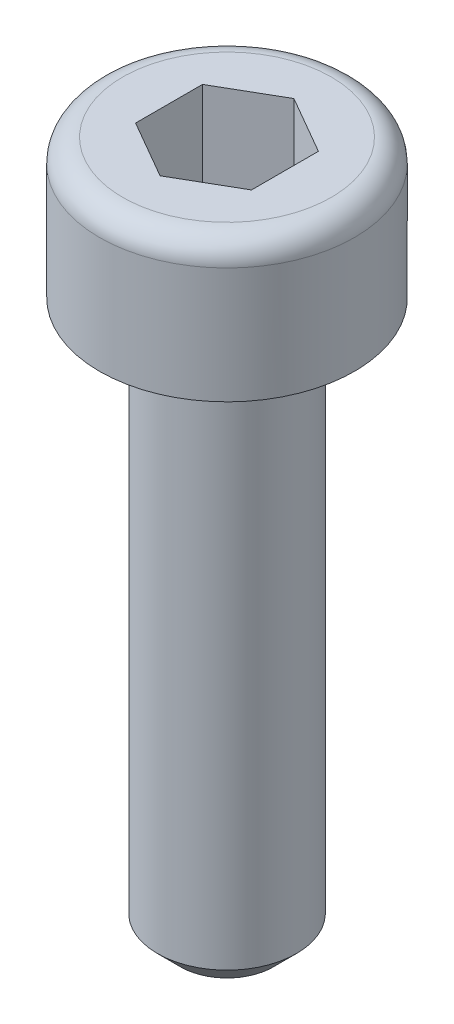
ISO-10303-21;
HEADER;
FILE_DESCRIPTION(('STEP AP214'),'2;1');
FILE_NAME('part.step','',(''),(''),'','','');
FILE_SCHEMA(('AUTOMOTIVE_DESIGN { 1 0 10303 214 1 1 1 1 }'));
ENDSEC;
DATA;
#1=APPLICATION_CONTEXT('core data for automotive mechanical design processes');
#2=APPLICATION_PROTOCOL_DEFINITION('international standard','automotive_design',2000,#1);
#3=PRODUCT_CONTEXT('',#1,'mechanical');
#4=PRODUCT('Part','Part','',(#3));
#5=PRODUCT_RELATED_PRODUCT_CATEGORY('part','',(#4));
#6=PRODUCT_DEFINITION_FORMATION('','',#4);
#7=PRODUCT_DEFINITION_CONTEXT('part definition',#1,'design');
#8=PRODUCT_DEFINITION('design','',#6,#7);
#9=PRODUCT_DEFINITION_SHAPE('','',#8);
#10=(LENGTH_UNIT() NAMED_UNIT(*) SI_UNIT(.MILLI.,.METRE.));
#11=(NAMED_UNIT(*) PLANE_ANGLE_UNIT() SI_UNIT($,.RADIAN.));
#12=(NAMED_UNIT(*) SI_UNIT($,.STERADIAN.) SOLID_ANGLE_UNIT());
#13=UNCERTAINTY_MEASURE_WITH_UNIT(LENGTH_MEASURE(1.E-05),#10,'distance_accuracy_value','');
#14=(GEOMETRIC_REPRESENTATION_CONTEXT(3) GLOBAL_UNCERTAINTY_ASSIGNED_CONTEXT((#13)) GLOBAL_UNIT_ASSIGNED_CONTEXT((#10,
#11,#12)) REPRESENTATION_CONTEXT('',''));
#15=CARTESIAN_POINT('',(0.,0.,0.));
#16=DIRECTION('',(0.,0.,1.));
#17=DIRECTION('',(1.,0.,0.));
#18=AXIS2_PLACEMENT_3D('',#15,#16,#17);
#19=CARTESIAN_POINT('',(0.,0.,0.));
#20=DIRECTION('',(0.,-1.,0.));
#21=DIRECTION('',(0.,0.,-1.));
#22=AXIS2_PLACEMENT_3D('',#19,#20,#21);
#23=PLANE('',#22);
#24=CARTESIAN_POINT('',(0.,0.,0.));
#25=DIRECTION('',(0.,-1.,0.));
#26=DIRECTION('',(0.,0.,-1.));
#27=AXIS2_PLACEMENT_3D('',#24,#25,#26);
#28=CIRCLE('',#27,2.25);
#29=CARTESIAN_POINT('',(0.,0.,-2.25));
#30=VERTEX_POINT('',#29);
#31=EDGE_CURVE('E43',#30,#30,#28,.F.);
#32=ORIENTED_EDGE('',*,*,#31,.T.);
#33=EDGE_LOOP('',(#32));
#34=FACE_BOUND('',#33,.T.);
#35=DIRECTION('',(-0.866025403784439,0.,-0.5));
#36=VECTOR('',#35,1.);
#37=CARTESIAN_POINT('',(1.25,0.,-0.721687836487032));
#38=LINE('',#37,#36);
#39=CARTESIAN_POINT('',(1.25,0.,-0.721687836487032));
#40=VERTEX_POINT('',#39);
#41=CARTESIAN_POINT('',(0.,0.,-1.44337567297406));
#42=VERTEX_POINT('',#41);
#43=EDGE_CURVE('E124',#40,#42,#38,.T.);
#44=ORIENTED_EDGE('',*,*,#43,.F.);
#45=DIRECTION('',(0.,0.,-1.));
#46=VECTOR('',#45,1.);
#47=CARTESIAN_POINT('',(1.25,0.,0.721687836487033));
#48=LINE('',#47,#46);
#49=CARTESIAN_POINT('',(1.25,0.,0.721687836487033));
#50=VERTEX_POINT('',#49);
#51=EDGE_CURVE('E50',#50,#40,#48,.T.);
#52=ORIENTED_EDGE('',*,*,#51,.F.);
#53=DIRECTION('',(0.866025403784439,0.,-0.5));
#54=VECTOR('',#53,1.);
#55=CARTESIAN_POINT('',(0.,0.,1.44337567297406));
#56=LINE('',#55,#54);
#57=CARTESIAN_POINT('',(0.,0.,1.44337567297406));
#58=VERTEX_POINT('',#57);
#59=EDGE_CURVE('E133',#58,#50,#56,.T.);
#60=ORIENTED_EDGE('',*,*,#59,.F.);
#61=DIRECTION('',(0.866025403784439,0.,0.5));
#62=VECTOR('',#61,1.);
#63=CARTESIAN_POINT('',(-1.25,0.,0.721687836487031));
#64=LINE('',#63,#62);
#65=CARTESIAN_POINT('',(-1.25,0.,0.721687836487031));
#66=VERTEX_POINT('',#65);
#67=EDGE_CURVE('E131',#66,#58,#64,.T.);
#68=ORIENTED_EDGE('',*,*,#67,.F.);
#69=DIRECTION('',(0.,0.,1.));
#70=VECTOR('',#69,1.);
#71=CARTESIAN_POINT('',(-1.25,0.,-0.721687836487033));
#72=LINE('',#71,#70);
#73=CARTESIAN_POINT('',(-1.25,0.,-0.721687836487033));
#74=VERTEX_POINT('',#73);
#75=EDGE_CURVE('E98',#74,#66,#72,.T.);
#76=ORIENTED_EDGE('',*,*,#75,.F.);
#77=DIRECTION('',(-0.866025403784439,0.,0.5));
#78=VECTOR('',#77,1.);
#79=CARTESIAN_POINT('',(0.,0.,-1.44337567297406));
#80=LINE('',#79,#78);
#81=EDGE_CURVE('E127',#42,#74,#80,.T.);
#82=ORIENTED_EDGE('',*,*,#81,.F.);
#83=EDGE_LOOP('',(#44,#52,#60,#68,#76,#82));
#84=FACE_BOUND('',#83,.T.);
#85=ADVANCED_FACE('F35',(#34,#84),#23,.F.);
#86=CARTESIAN_POINT('',(0.,0.,0.));
#87=DIRECTION('',(0.,1.,0.));
#88=DIRECTION('',(0.,0.,1.));
#89=AXIS2_PLACEMENT_3D('',#86,#87,#88);
#90=CYLINDRICAL_SURFACE('',#89,2.75);
#91=CARTESIAN_POINT('',(0.,-0.5,0.));
#92=DIRECTION('',(0.,-1.,0.));
#93=DIRECTION('',(0.,0.,-1.));
#94=AXIS2_PLACEMENT_3D('',#91,#92,#93);
#95=CIRCLE('',#94,2.75);
#96=CARTESIAN_POINT('',(0.,-0.5,-2.75));
#97=VERTEX_POINT('',#96);
#98=EDGE_CURVE('E11',#97,#97,#95,.T.);
#99=ORIENTED_EDGE('',*,*,#98,.T.);
#100=EDGE_LOOP('',(#99));
#101=FACE_BOUND('',#100,.T.);
#102=CARTESIAN_POINT('',(0.,-3.,0.));
#103=DIRECTION('',(0.,1.,0.));
#104=DIRECTION('',(0.,0.,1.));
#105=AXIS2_PLACEMENT_3D('',#102,#103,#104);
#106=CIRCLE('',#105,2.75);
#107=CARTESIAN_POINT('',(0.,-3.,2.75));
#108=VERTEX_POINT('',#107);
#109=EDGE_CURVE('E145',#108,#108,#106,.T.);
#110=ORIENTED_EDGE('',*,*,#109,.T.);
#111=EDGE_LOOP('',(#110));
#112=FACE_BOUND('',#111,.T.);
#113=ADVANCED_FACE('F167',(#101,#112),#90,.T.);
#114=CARTESIAN_POINT('',(2.75,-3.,0.));
#115=DIRECTION('',(0.,1.,0.));
#116=DIRECTION('',(0.,0.,1.));
#117=AXIS2_PLACEMENT_3D('',#114,#115,#116);
#118=PLANE('',#117);
#119=ORIENTED_EDGE('',*,*,#109,.F.);
#120=EDGE_LOOP('',(#119));
#121=FACE_BOUND('',#120,.T.);
#122=CARTESIAN_POINT('',(0.,-3.,0.));
#123=DIRECTION('',(0.,1.,0.));
#124=DIRECTION('',(0.,0.,1.));
#125=AXIS2_PLACEMENT_3D('',#122,#123,#124);
#126=CIRCLE('',#125,1.5);
#127=CARTESIAN_POINT('',(0.,-3.,1.5));
#128=VERTEX_POINT('',#127);
#129=EDGE_CURVE('E137',#128,#128,#126,.T.);
#130=ORIENTED_EDGE('',*,*,#129,.T.);
#131=EDGE_LOOP('',(#130));
#132=FACE_BOUND('',#131,.T.);
#133=ADVANCED_FACE('F172',(#121,#132),#118,.F.);
#134=CARTESIAN_POINT('',(0.,0.,0.));
#135=DIRECTION('',(0.,1.,0.));
#136=DIRECTION('',(0.,0.,1.));
#137=AXIS2_PLACEMENT_3D('',#134,#135,#136);
#138=CYLINDRICAL_SURFACE('',#137,1.5);
#139=CARTESIAN_POINT('',(0.,-14.5,0.));
#140=DIRECTION('',(0.,1.,0.));
#141=DIRECTION('',(0.,0.,1.));
#142=AXIS2_PLACEMENT_3D('',#139,#140,#141);
#143=CIRCLE('',#142,1.5);
#144=CARTESIAN_POINT('',(0.,-14.5,1.5));
#145=VERTEX_POINT('',#144);
#146=EDGE_CURVE('E148',#145,#145,#143,.T.);
#147=ORIENTED_EDGE('',*,*,#146,.T.);
#148=EDGE_LOOP('',(#147));
#149=FACE_BOUND('',#148,.T.);
#150=ORIENTED_EDGE('',*,*,#129,.F.);
#151=EDGE_LOOP('',(#150));
#152=FACE_BOUND('',#151,.T.);
#153=ADVANCED_FACE('F178',(#149,#152),#138,.T.);
#154=CARTESIAN_POINT('',(1.5,-15.,0.));
#155=DIRECTION('',(0.,1.,0.));
#156=DIRECTION('',(0.,0.,1.));
#157=AXIS2_PLACEMENT_3D('',#154,#155,#156);
#158=PLANE('',#157);
#159=CARTESIAN_POINT('',(0.,-15.,0.));
#160=DIRECTION('',(0.,1.,0.));
#161=DIRECTION('',(0.,0.,1.));
#162=AXIS2_PLACEMENT_3D('',#159,#160,#161);
#163=CIRCLE('',#162,1.);
#164=CARTESIAN_POINT('',(0.,-15.,1.));
#165=VERTEX_POINT('',#164);
#166=EDGE_CURVE('E151',#165,#165,#163,.F.);
#167=ORIENTED_EDGE('',*,*,#166,.T.);
#168=EDGE_LOOP('',(#167));
#169=FACE_BOUND('',#168,.T.);
#170=ADVANCED_FACE('F182',(#169),#158,.F.);
#171=CARTESIAN_POINT('',(1.25,-2.,0.721687836487033));
#172=DIRECTION('',(1.,0.,0.));
#173=DIRECTION('',(0.,0.,-1.));
#174=AXIS2_PLACEMENT_3D('',#171,#172,#173);
#175=PLANE('',#174);
#176=ORIENTED_EDGE('',*,*,#51,.T.);
#177=DIRECTION('',(0.,1.,0.));
#178=VECTOR('',#177,1.);
#179=CARTESIAN_POINT('',(1.25,-2.,-0.721687836487032));
#180=LINE('',#179,#178);
#181=CARTESIAN_POINT('',(1.25,-2.,-0.721687836487032));
#182=VERTEX_POINT('',#181);
#183=EDGE_CURVE('E80',#182,#40,#180,.T.);
#184=ORIENTED_EDGE('',*,*,#183,.F.);
#185=DIRECTION('',(0.,0.,-1.));
#186=VECTOR('',#185,1.);
#187=CARTESIAN_POINT('',(1.25,-2.,0.721687836487033));
#188=LINE('',#187,#186);
#189=CARTESIAN_POINT('',(1.25,-2.,0.721687836487033));
#190=VERTEX_POINT('',#189);
#191=EDGE_CURVE('E135',#190,#182,#188,.T.);
#192=ORIENTED_EDGE('',*,*,#191,.F.);
#193=DIRECTION('',(0.,1.,0.));
#194=VECTOR('',#193,1.);
#195=CARTESIAN_POINT('',(1.25,-2.,0.721687836487033));
#196=LINE('',#195,#194);
#197=EDGE_CURVE('E58',#190,#50,#196,.T.);
#198=ORIENTED_EDGE('',*,*,#197,.T.);
#199=EDGE_LOOP('',(#176,#184,#192,#198));
#200=FACE_BOUND('',#199,.T.);
#201=ADVANCED_FACE('F186',(#200),#175,.F.);
#202=CARTESIAN_POINT('',(0.,-2.,1.44337567297406));
#203=DIRECTION('',(0.5,0.,0.866025403784439));
#204=DIRECTION('',(0.866025403784439,0.,-0.5));
#205=AXIS2_PLACEMENT_3D('',#202,#203,#204);
#206=PLANE('',#205);
#207=ORIENTED_EDGE('',*,*,#59,.T.);
#208=ORIENTED_EDGE('',*,*,#197,.F.);
#209=DIRECTION('',(0.866025403784439,0.,-0.5));
#210=VECTOR('',#209,1.);
#211=CARTESIAN_POINT('',(0.,-2.,1.44337567297406));
#212=LINE('',#211,#210);
#213=CARTESIAN_POINT('',(0.,-2.,1.44337567297406));
#214=VERTEX_POINT('',#213);
#215=EDGE_CURVE('E110',#214,#190,#212,.T.);
#216=ORIENTED_EDGE('',*,*,#215,.F.);
#217=DIRECTION('',(0.,1.,0.));
#218=VECTOR('',#217,1.);
#219=CARTESIAN_POINT('',(0.,-2.,1.44337567297406));
#220=LINE('',#219,#218);
#221=EDGE_CURVE('E102',#214,#58,#220,.T.);
#222=ORIENTED_EDGE('',*,*,#221,.T.);
#223=EDGE_LOOP('',(#207,#208,#216,#222));
#224=FACE_BOUND('',#223,.T.);
#225=ADVANCED_FACE('F190',(#224),#206,.F.);
#226=CARTESIAN_POINT('',(-1.25,-2.,0.721687836487031));
#227=DIRECTION('',(-0.5,0.,0.866025403784439));
#228=DIRECTION('',(0.866025403784439,0.,0.5));
#229=AXIS2_PLACEMENT_3D('',#226,#227,#228);
#230=PLANE('',#229);
#231=ORIENTED_EDGE('',*,*,#67,.T.);
#232=ORIENTED_EDGE('',*,*,#221,.F.);
#233=DIRECTION('',(0.866025403784439,0.,0.5));
#234=VECTOR('',#233,1.);
#235=CARTESIAN_POINT('',(-1.25,-2.,0.721687836487031));
#236=LINE('',#235,#234);
#237=CARTESIAN_POINT('',(-1.25,-2.,0.721687836487031));
#238=VERTEX_POINT('',#237);
#239=EDGE_CURVE('E106',#238,#214,#236,.T.);
#240=ORIENTED_EDGE('',*,*,#239,.F.);
#241=DIRECTION('',(0.,1.,0.));
#242=VECTOR('',#241,1.);
#243=CARTESIAN_POINT('',(-1.25,-2.,0.721687836487031));
#244=LINE('',#243,#242);
#245=EDGE_CURVE('E91',#238,#66,#244,.T.);
#246=ORIENTED_EDGE('',*,*,#245,.T.);
#247=EDGE_LOOP('',(#231,#232,#240,#246));
#248=FACE_BOUND('',#247,.T.);
#249=ADVANCED_FACE('F107',(#248),#230,.F.);
#250=CARTESIAN_POINT('',(-1.25,-2.,-0.721687836487033));
#251=DIRECTION('',(-1.,0.,0.));
#252=DIRECTION('',(0.,0.,1.));
#253=AXIS2_PLACEMENT_3D('',#250,#251,#252);
#254=PLANE('',#253);
#255=ORIENTED_EDGE('',*,*,#75,.T.);
#256=ORIENTED_EDGE('',*,*,#245,.F.);
#257=DIRECTION('',(0.,0.,1.));
#258=VECTOR('',#257,1.);
#259=CARTESIAN_POINT('',(-1.25,-2.,-0.721687836487033));
#260=LINE('',#259,#258);
#261=CARTESIAN_POINT('',(-1.25,-2.,-0.721687836487033));
#262=VERTEX_POINT('',#261);
#263=EDGE_CURVE('E95',#262,#238,#260,.T.);
#264=ORIENTED_EDGE('',*,*,#263,.F.);
#265=DIRECTION('',(0.,1.,0.));
#266=VECTOR('',#265,1.);
#267=CARTESIAN_POINT('',(-1.25,-2.,-0.721687836487033));
#268=LINE('',#267,#266);
#269=EDGE_CURVE('E103',#262,#74,#268,.T.);
#270=ORIENTED_EDGE('',*,*,#269,.T.);
#271=EDGE_LOOP('',(#255,#256,#264,#270));
#272=FACE_BOUND('',#271,.T.);
#273=ADVANCED_FACE('F93',(#272),#254,.F.);
#274=CARTESIAN_POINT('',(0.,-2.,-1.44337567297406));
#275=DIRECTION('',(-0.5,0.,-0.866025403784439));
#276=DIRECTION('',(-0.866025403784439,0.,0.5));
#277=AXIS2_PLACEMENT_3D('',#274,#275,#276);
#278=PLANE('',#277);
#279=ORIENTED_EDGE('',*,*,#81,.T.);
#280=ORIENTED_EDGE('',*,*,#269,.F.);
#281=DIRECTION('',(-0.866025403784439,0.,0.5));
#282=VECTOR('',#281,1.);
#283=CARTESIAN_POINT('',(0.,-2.,-1.44337567297406));
#284=LINE('',#283,#282);
#285=CARTESIAN_POINT('',(0.,-2.,-1.44337567297406));
#286=VERTEX_POINT('',#285);
#287=EDGE_CURVE('E116',#286,#262,#284,.T.);
#288=ORIENTED_EDGE('',*,*,#287,.F.);
#289=DIRECTION('',(0.,1.,0.));
#290=VECTOR('',#289,1.);
#291=CARTESIAN_POINT('',(0.,-2.,-1.44337567297406));
#292=LINE('',#291,#290);
#293=EDGE_CURVE('E140',#286,#42,#292,.T.);
#294=ORIENTED_EDGE('',*,*,#293,.T.);
#295=EDGE_LOOP('',(#279,#280,#288,#294));
#296=FACE_BOUND('',#295,.T.);
#297=ADVANCED_FACE('F194',(#296),#278,.F.);
#298=CARTESIAN_POINT('',(1.25,-2.,-0.721687836487032));
#299=DIRECTION('',(0.5,0.,-0.866025403784439));
#300=DIRECTION('',(-0.866025403784439,0.,-0.5));
#301=AXIS2_PLACEMENT_3D('',#298,#299,#300);
#302=PLANE('',#301);
#303=ORIENTED_EDGE('',*,*,#43,.T.);
#304=ORIENTED_EDGE('',*,*,#293,.F.);
#305=DIRECTION('',(-0.866025403784439,0.,-0.5));
#306=VECTOR('',#305,1.);
#307=CARTESIAN_POINT('',(1.25,-2.,-0.721687836487032));
#308=LINE('',#307,#306);
#309=EDGE_CURVE('E118',#182,#286,#308,.T.);
#310=ORIENTED_EDGE('',*,*,#309,.F.);
#311=ORIENTED_EDGE('',*,*,#183,.T.);
#312=EDGE_LOOP('',(#303,#304,#310,#311));
#313=FACE_BOUND('',#312,.T.);
#314=ADVANCED_FACE('F191',(#313),#302,.F.);
#315=CARTESIAN_POINT('',(1.25,-2.,-0.721687836487032));
#316=DIRECTION('',(0.,1.,0.));
#317=DIRECTION('',(0.,0.,1.));
#318=AXIS2_PLACEMENT_3D('',#315,#316,#317);
#319=PLANE('',#318);
#320=ORIENTED_EDGE('',*,*,#191,.T.);
#321=ORIENTED_EDGE('',*,*,#309,.T.);
#322=ORIENTED_EDGE('',*,*,#287,.T.);
#323=ORIENTED_EDGE('',*,*,#263,.T.);
#324=ORIENTED_EDGE('',*,*,#239,.T.);
#325=ORIENTED_EDGE('',*,*,#215,.T.);
#326=EDGE_LOOP('',(#320,#321,#322,#323,#324,#325));
#327=FACE_BOUND('',#326,.T.);
#328=ADVANCED_FACE('F113',(#327),#319,.T.);
#329=CARTESIAN_POINT('',(0.,-14.5,0.));
#330=DIRECTION('',(0.,1.,0.));
#331=DIRECTION('',(0.,0.,1.));
#332=AXIS2_PLACEMENT_3D('',#329,#330,#331);
#333=CONICAL_SURFACE('',#332,1.5,0.785398163397451);
#334=ORIENTED_EDGE('',*,*,#166,.F.);
#335=EDGE_LOOP('',(#334));
#336=FACE_BOUND('',#335,.T.);
#337=ORIENTED_EDGE('',*,*,#146,.F.);
#338=EDGE_LOOP('',(#337));
#339=FACE_BOUND('',#338,.T.);
#340=ADVANCED_FACE('F159',(#336,#339),#333,.T.);
#341=CARTESIAN_POINT('',(0.,-0.5,0.));
#342=DIRECTION('',(0.,-1.,0.));
#343=DIRECTION('',(0.,0.,-1.));
#344=AXIS2_PLACEMENT_3D('',#341,#342,#343);
#345=TOROIDAL_SURFACE('',#344,2.25,0.5);
#346=ORIENTED_EDGE('',*,*,#98,.F.);
#347=EDGE_LOOP('',(#346));
#348=FACE_BOUND('',#347,.T.);
#349=ORIENTED_EDGE('',*,*,#31,.F.);
#350=EDGE_LOOP('',(#349));
#351=FACE_BOUND('',#350,.T.);
#352=ADVANCED_FACE('F37',(#348,#351),#345,.T.);
#353=CLOSED_SHELL('',(#85,#113,#133,#153,#170,#201,#225,#249,#273,#297,#314,#328,#340,#352));
#354=MANIFOLD_SOLID_BREP('B2',#353);
#355=ADVANCED_BREP_SHAPE_REPRESENTATION('',(#18,#354),#14);
#356=SHAPE_DEFINITION_REPRESENTATION(#9,#355);
ENDSEC;
END-ISO-10303-21;
